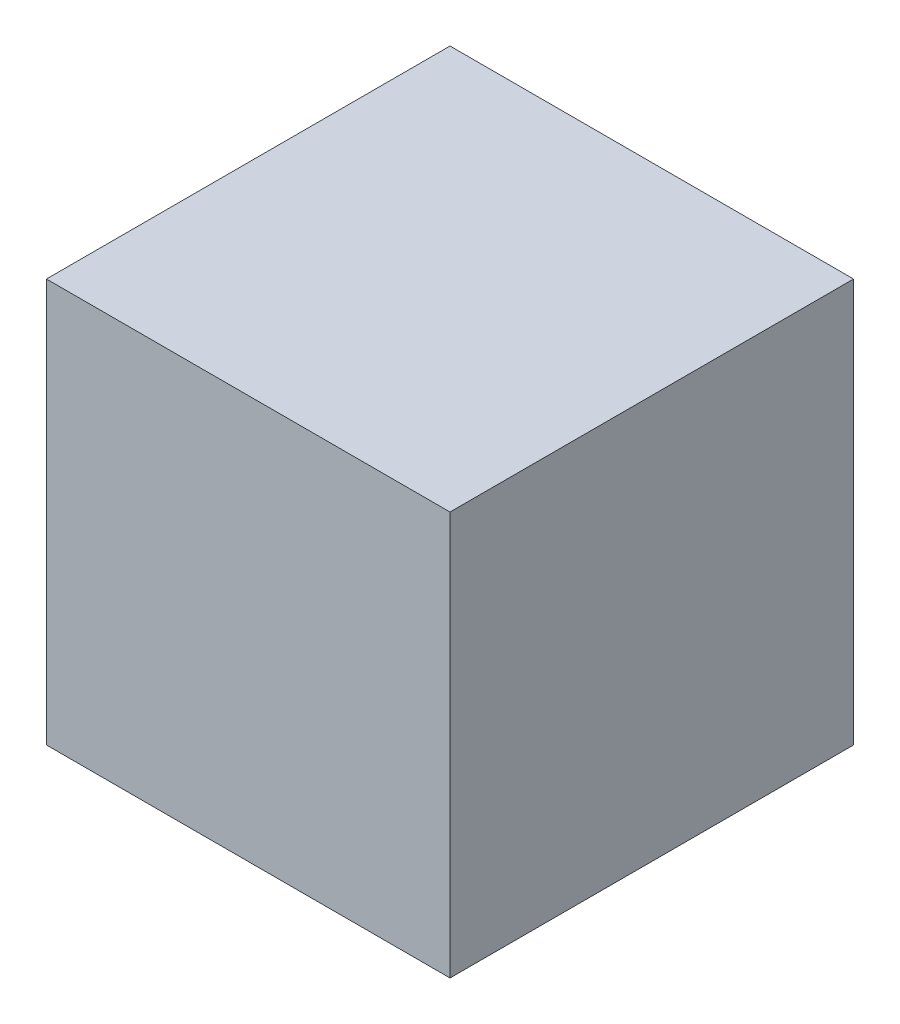
ISO-10303-21;
HEADER;
FILE_DESCRIPTION(('STEP AP214'),'2;1');
FILE_NAME('part.step','',(''),(''),'','','');
FILE_SCHEMA(('AUTOMOTIVE_DESIGN { 1 0 10303 214 1 1 1 1 }'));
ENDSEC;
DATA;
#1=APPLICATION_CONTEXT('core data for automotive mechanical design processes');
#2=APPLICATION_PROTOCOL_DEFINITION('international standard','automotive_design',2000,#1);
#3=PRODUCT_CONTEXT('',#1,'mechanical');
#4=PRODUCT('Part','Part','',(#3));
#5=PRODUCT_RELATED_PRODUCT_CATEGORY('part','',(#4));
#6=PRODUCT_DEFINITION_FORMATION('','',#4);
#7=PRODUCT_DEFINITION_CONTEXT('part definition',#1,'design');
#8=PRODUCT_DEFINITION('design','',#6,#7);
#9=PRODUCT_DEFINITION_SHAPE('','',#8);
#10=(LENGTH_UNIT() NAMED_UNIT(*) SI_UNIT(.MILLI.,.METRE.));
#11=(NAMED_UNIT(*) PLANE_ANGLE_UNIT() SI_UNIT($,.RADIAN.));
#12=(NAMED_UNIT(*) SI_UNIT($,.STERADIAN.) SOLID_ANGLE_UNIT());
#13=UNCERTAINTY_MEASURE_WITH_UNIT(LENGTH_MEASURE(1.E-05),#10,'distance_accuracy_value','');
#14=(GEOMETRIC_REPRESENTATION_CONTEXT(3) GLOBAL_UNCERTAINTY_ASSIGNED_CONTEXT((#13)) GLOBAL_UNIT_ASSIGNED_CONTEXT((#10,
#11,#12)) REPRESENTATION_CONTEXT('',''));
#15=CARTESIAN_POINT('',(0.,0.,0.));
#16=DIRECTION('',(0.,0.,1.));
#17=DIRECTION('',(1.,0.,0.));
#18=AXIS2_PLACEMENT_3D('',#15,#16,#17);
#19=CARTESIAN_POINT('',(20.,20.,40.));
#20=DIRECTION('',(-1.,0.,0.));
#21=DIRECTION('',(0.,0.,1.));
#22=AXIS2_PLACEMENT_3D('',#19,#20,#21);
#23=PLANE('',#22);
#24=DIRECTION('',(0.,1.,0.));
#25=VECTOR('',#24,1.);
#26=CARTESIAN_POINT('',(20.,20.,0.));
#27=LINE('',#26,#25);
#28=CARTESIAN_POINT('',(20.,-20.,0.));
#29=VERTEX_POINT('',#28);
#30=CARTESIAN_POINT('',(20.,20.,0.));
#31=VERTEX_POINT('',#30);
#32=EDGE_CURVE('E106',#29,#31,#27,.T.);
#33=ORIENTED_EDGE('',*,*,#32,.T.);
#34=DIRECTION('',(0.,0.,-1.));
#35=VECTOR('',#34,1.);
#36=CARTESIAN_POINT('',(20.,20.,40.));
#37=LINE('',#36,#35);
#38=CARTESIAN_POINT('',(20.,20.,40.));
#39=VERTEX_POINT('',#38);
#40=EDGE_CURVE('E11',#39,#31,#37,.T.);
#41=ORIENTED_EDGE('',*,*,#40,.F.);
#42=DIRECTION('',(0.,1.,0.));
#43=VECTOR('',#42,1.);
#44=CARTESIAN_POINT('',(20.,20.,40.));
#45=LINE('',#44,#43);
#46=CARTESIAN_POINT('',(20.,-20.,40.));
#47=VERTEX_POINT('',#46);
#48=EDGE_CURVE('E94',#47,#39,#45,.T.);
#49=ORIENTED_EDGE('',*,*,#48,.F.);
#50=DIRECTION('',(0.,0.,-1.));
#51=VECTOR('',#50,1.);
#52=CARTESIAN_POINT('',(20.,-20.,40.));
#53=LINE('',#52,#51);
#54=EDGE_CURVE('E102',#47,#29,#53,.T.);
#55=ORIENTED_EDGE('',*,*,#54,.T.);
#56=EDGE_LOOP('',(#33,#41,#49,#55));
#57=FACE_BOUND('',#56,.T.);
#58=ADVANCED_FACE('F43',(#57),#23,.F.);
#59=CARTESIAN_POINT('',(-20.,20.,40.));
#60=DIRECTION('',(0.,-1.,0.));
#61=DIRECTION('',(0.,0.,-1.));
#62=AXIS2_PLACEMENT_3D('',#59,#60,#61);
#63=PLANE('',#62);
#64=DIRECTION('',(-1.,0.,0.));
#65=VECTOR('',#64,1.);
#66=CARTESIAN_POINT('',(-20.,20.,0.));
#67=LINE('',#66,#65);
#68=CARTESIAN_POINT('',(-20.,20.,0.));
#69=VERTEX_POINT('',#68);
#70=EDGE_CURVE('E98',#31,#69,#67,.T.);
#71=ORIENTED_EDGE('',*,*,#70,.T.);
#72=DIRECTION('',(0.,0.,-1.));
#73=VECTOR('',#72,1.);
#74=CARTESIAN_POINT('',(-20.,20.,40.));
#75=LINE('',#74,#73);
#76=CARTESIAN_POINT('',(-20.,20.,40.));
#77=VERTEX_POINT('',#76);
#78=EDGE_CURVE('E51',#77,#69,#75,.T.);
#79=ORIENTED_EDGE('',*,*,#78,.F.);
#80=DIRECTION('',(-1.,0.,0.));
#81=VECTOR('',#80,1.);
#82=CARTESIAN_POINT('',(-20.,20.,40.));
#83=LINE('',#82,#81);
#84=EDGE_CURVE('E89',#39,#77,#83,.T.);
#85=ORIENTED_EDGE('',*,*,#84,.F.);
#86=ORIENTED_EDGE('',*,*,#40,.T.);
#87=EDGE_LOOP('',(#71,#79,#85,#86));
#88=FACE_BOUND('',#87,.T.);
#89=ADVANCED_FACE('F97',(#88),#63,.F.);
#90=CARTESIAN_POINT('',(-20.,20.,40.));
#91=DIRECTION('',(1.,0.,0.));
#92=DIRECTION('',(0.,1.,0.));
#93=AXIS2_PLACEMENT_3D('',#90,#91,#92);
#94=PLANE('',#93);
#95=DIRECTION('',(0.,-1.,0.));
#96=VECTOR('',#95,1.);
#97=CARTESIAN_POINT('',(-20.,20.,0.));
#98=LINE('',#97,#96);
#99=CARTESIAN_POINT('',(-20.,-20.,0.));
#100=VERTEX_POINT('',#99);
#101=EDGE_CURVE('E76',#69,#100,#98,.T.);
#102=ORIENTED_EDGE('',*,*,#101,.T.);
#103=DIRECTION('',(0.,0.,-1.));
#104=VECTOR('',#103,1.);
#105=CARTESIAN_POINT('',(-20.,-20.,40.));
#106=LINE('',#105,#104);
#107=CARTESIAN_POINT('',(-20.,-20.,40.));
#108=VERTEX_POINT('',#107);
#109=EDGE_CURVE('E99',#108,#100,#106,.T.);
#110=ORIENTED_EDGE('',*,*,#109,.F.);
#111=DIRECTION('',(0.,-1.,0.));
#112=VECTOR('',#111,1.);
#113=CARTESIAN_POINT('',(-20.,20.,40.));
#114=LINE('',#113,#112);
#115=EDGE_CURVE('E92',#77,#108,#114,.T.);
#116=ORIENTED_EDGE('',*,*,#115,.F.);
#117=ORIENTED_EDGE('',*,*,#78,.T.);
#118=EDGE_LOOP('',(#102,#110,#116,#117));
#119=FACE_BOUND('',#118,.T.);
#120=ADVANCED_FACE('F100',(#119),#94,.F.);
#121=CARTESIAN_POINT('',(-20.,-20.,40.));
#122=DIRECTION('',(0.,1.,0.));
#123=DIRECTION('',(0.,0.,1.));
#124=AXIS2_PLACEMENT_3D('',#121,#122,#123);
#125=PLANE('',#124);
#126=DIRECTION('',(1.,0.,0.));
#127=VECTOR('',#126,1.);
#128=CARTESIAN_POINT('',(-20.,-20.,0.));
#129=LINE('',#128,#127);
#130=EDGE_CURVE('E82',#100,#29,#129,.T.);
#131=ORIENTED_EDGE('',*,*,#130,.T.);
#132=ORIENTED_EDGE('',*,*,#54,.F.);
#133=DIRECTION('',(1.,0.,0.));
#134=VECTOR('',#133,1.);
#135=CARTESIAN_POINT('',(-20.,-20.,40.));
#136=LINE('',#135,#134);
#137=EDGE_CURVE('E59',#108,#47,#136,.T.);
#138=ORIENTED_EDGE('',*,*,#137,.F.);
#139=ORIENTED_EDGE('',*,*,#109,.T.);
#140=EDGE_LOOP('',(#131,#132,#138,#139));
#141=FACE_BOUND('',#140,.T.);
#142=ADVANCED_FACE('F113',(#141),#125,.F.);
#143=CARTESIAN_POINT('',(0.,0.,40.));
#144=DIRECTION('',(0.,0.,1.));
#145=DIRECTION('',(1.,0.,0.));
#146=AXIS2_PLACEMENT_3D('',#143,#144,#145);
#147=PLANE('',#146);
#148=ORIENTED_EDGE('',*,*,#48,.T.);
#149=ORIENTED_EDGE('',*,*,#84,.T.);
#150=ORIENTED_EDGE('',*,*,#115,.T.);
#151=ORIENTED_EDGE('',*,*,#137,.T.);
#152=EDGE_LOOP('',(#148,#149,#150,#151));
#153=FACE_BOUND('',#152,.T.);
#154=ADVANCED_FACE('F90',(#153),#147,.T.);
#155=CARTESIAN_POINT('',(0.,0.,0.));
#156=DIRECTION('',(0.,0.,1.));
#157=DIRECTION('',(1.,0.,0.));
#158=AXIS2_PLACEMENT_3D('',#155,#156,#157);
#159=PLANE('',#158);
#160=ORIENTED_EDGE('',*,*,#32,.F.);
#161=ORIENTED_EDGE('',*,*,#130,.F.);
#162=ORIENTED_EDGE('',*,*,#101,.F.);
#163=ORIENTED_EDGE('',*,*,#70,.F.);
#164=EDGE_LOOP('',(#160,#161,#162,#163));
#165=FACE_BOUND('',#164,.T.);
#166=ADVANCED_FACE('F116',(#165),#159,.F.);
#167=CLOSED_SHELL('',(#58,#89,#120,#142,#154,#166));
#168=MANIFOLD_SOLID_BREP('B2',#167);
#169=ADVANCED_BREP_SHAPE_REPRESENTATION('',(#18,#168),#14);
#170=SHAPE_DEFINITION_REPRESENTATION(#9,#169);
ENDSEC;
END-ISO-10303-21;
